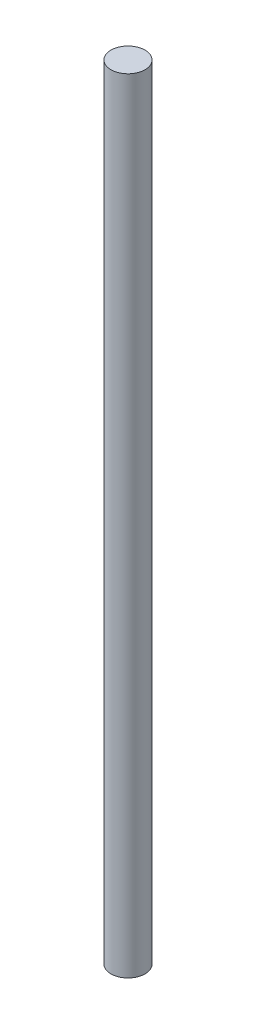
ISO-10303-21;
HEADER;
FILE_DESCRIPTION(('STEP AP214'),'2;1');
FILE_NAME('part.step','',(''),(''),'','','');
FILE_SCHEMA(('AUTOMOTIVE_DESIGN { 1 0 10303 214 1 1 1 1 }'));
ENDSEC;
DATA;
#1=APPLICATION_CONTEXT('core data for automotive mechanical design processes');
#2=APPLICATION_PROTOCOL_DEFINITION('international standard','automotive_design',2000,#1);
#3=PRODUCT_CONTEXT('',#1,'mechanical');
#4=PRODUCT('Part','Part','',(#3));
#5=PRODUCT_RELATED_PRODUCT_CATEGORY('part','',(#4));
#6=PRODUCT_DEFINITION_FORMATION('','',#4);
#7=PRODUCT_DEFINITION_CONTEXT('part definition',#1,'design');
#8=PRODUCT_DEFINITION('design','',#6,#7);
#9=PRODUCT_DEFINITION_SHAPE('','',#8);
#10=(LENGTH_UNIT() NAMED_UNIT(*) SI_UNIT(.MILLI.,.METRE.));
#11=(NAMED_UNIT(*) PLANE_ANGLE_UNIT() SI_UNIT($,.RADIAN.));
#12=(NAMED_UNIT(*) SI_UNIT($,.STERADIAN.) SOLID_ANGLE_UNIT());
#13=UNCERTAINTY_MEASURE_WITH_UNIT(LENGTH_MEASURE(1.E-05),#10,'distance_accuracy_value','');
#14=(GEOMETRIC_REPRESENTATION_CONTEXT(3) GLOBAL_UNCERTAINTY_ASSIGNED_CONTEXT((#13)) GLOBAL_UNIT_ASSIGNED_CONTEXT((#10,
#11,#12)) REPRESENTATION_CONTEXT('',''));
#15=CARTESIAN_POINT('',(0.,0.,0.));
#16=DIRECTION('',(0.,0.,1.));
#17=DIRECTION('',(1.,0.,0.));
#18=AXIS2_PLACEMENT_3D('',#15,#16,#17);
#19=CARTESIAN_POINT('',(0.,230.,0.));
#20=DIRECTION('',(0.,-1.,0.));
#21=DIRECTION('',(0.,0.,-1.));
#22=AXIS2_PLACEMENT_3D('',#19,#20,#21);
#23=CYLINDRICAL_SURFACE('',#22,5.);
#24=CARTESIAN_POINT('',(0.,230.,0.));
#25=DIRECTION('',(0.,1.,0.));
#26=DIRECTION('',(0.,0.,1.));
#27=AXIS2_PLACEMENT_3D('',#24,#25,#26);
#28=CIRCLE('',#27,5.);
#29=CARTESIAN_POINT('',(0.,230.,5.));
#30=VERTEX_POINT('',#29);
#31=EDGE_CURVE('E10',#30,#30,#28,.T.);
#32=ORIENTED_EDGE('',*,*,#31,.F.);
#33=EDGE_LOOP('',(#32));
#34=FACE_BOUND('',#33,.T.);
#35=CARTESIAN_POINT('',(0.,0.,0.));
#36=DIRECTION('',(0.,1.,0.));
#37=DIRECTION('',(0.,0.,1.));
#38=AXIS2_PLACEMENT_3D('',#35,#36,#37);
#39=CIRCLE('',#38,5.);
#40=CARTESIAN_POINT('',(0.,0.,5.));
#41=VERTEX_POINT('',#40);
#42=EDGE_CURVE('E34',#41,#41,#39,.T.);
#43=ORIENTED_EDGE('',*,*,#42,.T.);
#44=EDGE_LOOP('',(#43));
#45=FACE_BOUND('',#44,.T.);
#46=ADVANCED_FACE('F31',(#34,#45),#23,.T.);
#47=CARTESIAN_POINT('',(0.,230.,0.));
#48=DIRECTION('',(0.,1.,0.));
#49=DIRECTION('',(0.,0.,1.));
#50=AXIS2_PLACEMENT_3D('',#47,#48,#49);
#51=PLANE('',#50);
#52=ORIENTED_EDGE('',*,*,#31,.T.);
#53=EDGE_LOOP('',(#52));
#54=FACE_BOUND('',#53,.T.);
#55=ADVANCED_FACE('F46',(#54),#51,.T.);
#56=CARTESIAN_POINT('',(0.,0.,0.));
#57=DIRECTION('',(0.,1.,0.));
#58=DIRECTION('',(0.,0.,1.));
#59=AXIS2_PLACEMENT_3D('',#56,#57,#58);
#60=PLANE('',#59);
#61=ORIENTED_EDGE('',*,*,#42,.F.);
#62=EDGE_LOOP('',(#61));
#63=FACE_BOUND('',#62,.T.);
#64=ADVANCED_FACE('F44',(#63),#60,.F.);
#65=CLOSED_SHELL('',(#46,#55,#64));
#66=MANIFOLD_SOLID_BREP('B2',#65);
#67=ADVANCED_BREP_SHAPE_REPRESENTATION('',(#18,#66),#14);
#68=SHAPE_DEFINITION_REPRESENTATION(#9,#67);
ENDSEC;
END-ISO-10303-21;
